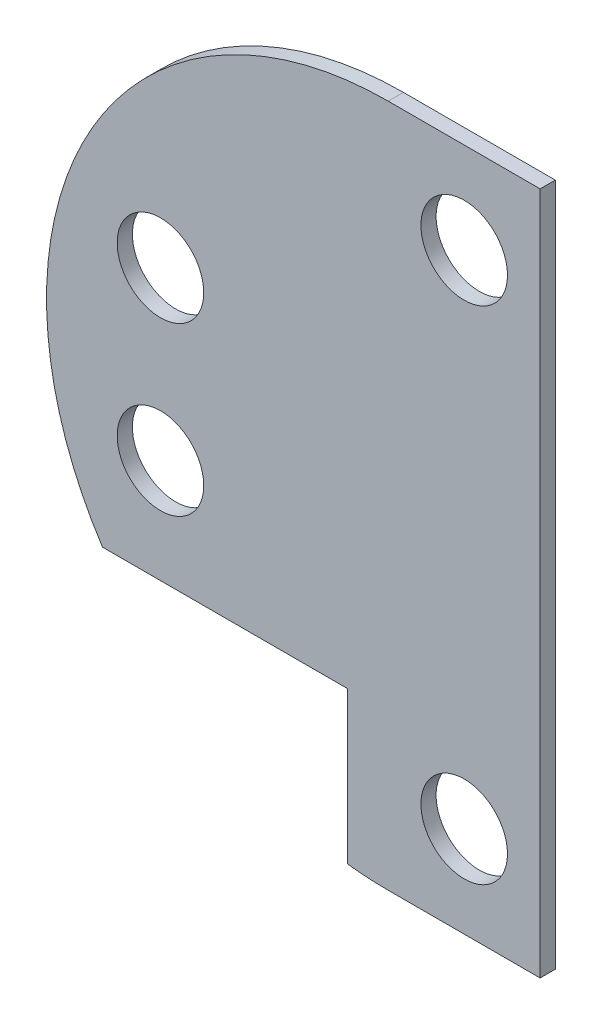
ISO-10303-21;
HEADER;
FILE_DESCRIPTION(('STEP AP214'),'2;1');
FILE_NAME('part.step','',(''),(''),'','','');
FILE_SCHEMA(('AUTOMOTIVE_DESIGN { 1 0 10303 214 1 1 1 1 }'));
ENDSEC;
DATA;
#1=APPLICATION_CONTEXT('core data for automotive mechanical design processes');
#2=APPLICATION_PROTOCOL_DEFINITION('international standard','automotive_design',2000,#1);
#3=PRODUCT_CONTEXT('',#1,'mechanical');
#4=PRODUCT('Part','Part','',(#3));
#5=PRODUCT_RELATED_PRODUCT_CATEGORY('part','',(#4));
#6=PRODUCT_DEFINITION_FORMATION('','',#4);
#7=PRODUCT_DEFINITION_CONTEXT('part definition',#1,'design');
#8=PRODUCT_DEFINITION('design','',#6,#7);
#9=PRODUCT_DEFINITION_SHAPE('','',#8);
#10=(LENGTH_UNIT() NAMED_UNIT(*) SI_UNIT(.MILLI.,.METRE.));
#11=(NAMED_UNIT(*) PLANE_ANGLE_UNIT() SI_UNIT($,.RADIAN.));
#12=(NAMED_UNIT(*) SI_UNIT($,.STERADIAN.) SOLID_ANGLE_UNIT());
#13=UNCERTAINTY_MEASURE_WITH_UNIT(LENGTH_MEASURE(1.E-05),#10,'distance_accuracy_value','');
#14=(GEOMETRIC_REPRESENTATION_CONTEXT(3) GLOBAL_UNCERTAINTY_ASSIGNED_CONTEXT((#13)) GLOBAL_UNIT_ASSIGNED_CONTEXT((#10,
#11,#12)) REPRESENTATION_CONTEXT('',''));
#15=CARTESIAN_POINT('',(0.,0.,0.));
#16=DIRECTION('',(0.,0.,1.));
#17=DIRECTION('',(1.,0.,0.));
#18=AXIS2_PLACEMENT_3D('',#15,#16,#17);
#19=CARTESIAN_POINT('',(-5.,0.,1.));
#20=DIRECTION('',(0.,0.,-1.));
#21=DIRECTION('',(-1.,0.,0.));
#22=AXIS2_PLACEMENT_3D('',#19,#20,#21);
#23=CYLINDRICAL_SURFACE('',#22,22.5);
#24=DIRECTION('',(0.,0.,-1.));
#25=VECTOR('',#24,1.);
#26=CARTESIAN_POINT('',(-23.8142073976025,-12.34,1.));
#27=LINE('',#26,#25);
#28=CARTESIAN_POINT('',(-23.8142073976025,-12.34,1.));
#29=VERTEX_POINT('',#28);
#30=CARTESIAN_POINT('',(-23.8142073976025,-12.34,0.));
#31=VERTEX_POINT('',#30);
#32=EDGE_CURVE('E117',#29,#31,#27,.T.);
#33=ORIENTED_EDGE('',*,*,#32,.F.);
#34=CARTESIAN_POINT('',(-5.,0.,1.));
#35=DIRECTION('',(0.,0.,1.));
#36=DIRECTION('',(-1.,0.,0.));
#37=AXIS2_PLACEMENT_3D('',#34,#35,#36);
#38=CIRCLE('',#37,22.5);
#39=CARTESIAN_POINT('',(-5.,22.5,1.));
#40=VERTEX_POINT('',#39);
#41=EDGE_CURVE('E128',#40,#29,#38,.T.);
#42=ORIENTED_EDGE('',*,*,#41,.F.);
#43=DIRECTION('',(0.,0.,-1.));
#44=VECTOR('',#43,1.);
#45=CARTESIAN_POINT('',(-5.,22.5,1.));
#46=LINE('',#45,#44);
#47=CARTESIAN_POINT('',(-5.,22.5,0.));
#48=VERTEX_POINT('',#47);
#49=EDGE_CURVE('E48',#40,#48,#46,.T.);
#50=ORIENTED_EDGE('',*,*,#49,.T.);
#51=CARTESIAN_POINT('',(-5.,0.,0.));
#52=DIRECTION('',(0.,0.,1.));
#53=DIRECTION('',(-1.,0.,0.));
#54=AXIS2_PLACEMENT_3D('',#51,#52,#53);
#55=CIRCLE('',#54,22.5);
#56=EDGE_CURVE('E143',#48,#31,#55,.T.);
#57=ORIENTED_EDGE('',*,*,#56,.T.);
#58=EDGE_LOOP('',(#33,#42,#50,#57));
#59=FACE_BOUND('',#58,.T.);
#60=ADVANCED_FACE('F40',(#59),#23,.T.);
#61=CARTESIAN_POINT('',(-5.,0.,1.));
#62=DIRECTION('',(0.,0.,-1.));
#63=DIRECTION('',(-1.,0.,0.));
#64=AXIS2_PLACEMENT_3D('',#61,#62,#63);
#65=PLANE('',#64);
#66=DIRECTION('',(-1.,0.,0.));
#67=VECTOR('',#66,1.);
#68=CARTESIAN_POINT('',(-7.7,-12.34,1.));
#69=LINE('',#68,#67);
#70=CARTESIAN_POINT('',(-7.7,-12.34,1.));
#71=VERTEX_POINT('',#70);
#72=EDGE_CURVE('E55',#71,#29,#69,.T.);
#73=ORIENTED_EDGE('',*,*,#72,.F.);
#74=DIRECTION('',(0.,-1.,0.));
#75=VECTOR('',#74,1.);
#76=CARTESIAN_POINT('',(-7.7,-12.34,1.));
#77=LINE('',#76,#75);
#78=CARTESIAN_POINT('',(-7.69999999999999,-22.3374125627835,1.));
#79=VERTEX_POINT('',#78);
#80=EDGE_CURVE('E111',#71,#79,#77,.T.);
#81=ORIENTED_EDGE('',*,*,#80,.T.);
#82=CARTESIAN_POINT('',(-5.,-22.5,1.));
#83=VERTEX_POINT('',#82);
#84=EDGE_CURVE('E121',#79,#83,#38,.T.);
#85=ORIENTED_EDGE('',*,*,#84,.T.);
#86=DIRECTION('',(1.,0.,0.));
#87=VECTOR('',#86,1.);
#88=CARTESIAN_POINT('',(-5.,-22.5,1.));
#89=LINE('',#88,#87);
#90=CARTESIAN_POINT('',(5.,-22.5,1.));
#91=VERTEX_POINT('',#90);
#92=EDGE_CURVE('E64',#83,#91,#89,.T.);
#93=ORIENTED_EDGE('',*,*,#92,.T.);
#94=DIRECTION('',(0.,1.,0.));
#95=VECTOR('',#94,1.);
#96=CARTESIAN_POINT('',(5.,-22.5,1.));
#97=LINE('',#96,#95);
#98=CARTESIAN_POINT('',(5.,22.5,1.));
#99=VERTEX_POINT('',#98);
#100=EDGE_CURVE('E130',#91,#99,#97,.T.);
#101=ORIENTED_EDGE('',*,*,#100,.T.);
#102=DIRECTION('',(-1.,0.,0.));
#103=VECTOR('',#102,1.);
#104=CARTESIAN_POINT('',(-5.,22.5,1.));
#105=LINE('',#104,#103);
#106=EDGE_CURVE('E92',#99,#40,#105,.T.);
#107=ORIENTED_EDGE('',*,*,#106,.T.);
#108=ORIENTED_EDGE('',*,*,#41,.T.);
#109=EDGE_LOOP('',(#73,#81,#85,#93,#101,#107,#108));
#110=FACE_BOUND('',#109,.T.);
#111=CARTESIAN_POINT('',(0.,16.5,1.));
#112=DIRECTION('',(0.,0.,1.));
#113=DIRECTION('',(1.,0.,0.));
#114=AXIS2_PLACEMENT_3D('',#111,#112,#113);
#115=CIRCLE('',#114,2.85);
#116=CARTESIAN_POINT('',(2.85,16.5,1.));
#117=VERTEX_POINT('',#116);
#118=EDGE_CURVE('E140',#117,#117,#115,.T.);
#119=ORIENTED_EDGE('',*,*,#118,.F.);
#120=EDGE_LOOP('',(#119));
#121=FACE_BOUND('',#120,.T.);
#122=CARTESIAN_POINT('',(0.,-16.5,1.));
#123=DIRECTION('',(0.,0.,1.));
#124=DIRECTION('',(1.,0.,0.));
#125=AXIS2_PLACEMENT_3D('',#122,#123,#124);
#126=CIRCLE('',#125,2.85);
#127=CARTESIAN_POINT('',(2.85,-16.5,1.));
#128=VERTEX_POINT('',#127);
#129=EDGE_CURVE('E178',#128,#128,#126,.T.);
#130=ORIENTED_EDGE('',*,*,#129,.F.);
#131=EDGE_LOOP('',(#130));
#132=FACE_BOUND('',#131,.T.);
#133=CARTESIAN_POINT('',(-20.,-5.5,1.));
#134=DIRECTION('',(0.,0.,1.));
#135=DIRECTION('',(1.,0.,0.));
#136=AXIS2_PLACEMENT_3D('',#133,#134,#135);
#137=CIRCLE('',#136,2.85);
#138=CARTESIAN_POINT('',(-17.15,-5.5,1.));
#139=VERTEX_POINT('',#138);
#140=EDGE_CURVE('E172',#139,#139,#137,.T.);
#141=ORIENTED_EDGE('',*,*,#140,.F.);
#142=EDGE_LOOP('',(#141));
#143=FACE_BOUND('',#142,.T.);
#144=CARTESIAN_POINT('',(-20.,5.5,1.));
#145=DIRECTION('',(0.,0.,1.));
#146=DIRECTION('',(1.,0.,0.));
#147=AXIS2_PLACEMENT_3D('',#144,#145,#146);
#148=CIRCLE('',#147,2.85);
#149=CARTESIAN_POINT('',(-17.15,5.5,1.));
#150=VERTEX_POINT('',#149);
#151=EDGE_CURVE('E166',#150,#150,#148,.T.);
#152=ORIENTED_EDGE('',*,*,#151,.F.);
#153=EDGE_LOOP('',(#152));
#154=FACE_BOUND('',#153,.T.);
#155=ADVANCED_FACE('F119',(#110,#121,#132,#143,#154),#65,.F.);
#156=CARTESIAN_POINT('',(-5.,0.,0.));
#157=DIRECTION('',(0.,0.,-1.));
#158=DIRECTION('',(-1.,0.,0.));
#159=AXIS2_PLACEMENT_3D('',#156,#157,#158);
#160=PLANE('',#159);
#161=DIRECTION('',(0.,-1.,0.));
#162=VECTOR('',#161,1.);
#163=CARTESIAN_POINT('',(-7.7,-12.34,0.));
#164=LINE('',#163,#162);
#165=CARTESIAN_POINT('',(-7.7,-12.34,0.));
#166=VERTEX_POINT('',#165);
#167=CARTESIAN_POINT('',(-7.69999999999999,-22.3374125627835,0.));
#168=VERTEX_POINT('',#167);
#169=EDGE_CURVE('E113',#166,#168,#164,.T.);
#170=ORIENTED_EDGE('',*,*,#169,.F.);
#171=DIRECTION('',(-1.,0.,0.));
#172=VECTOR('',#171,1.);
#173=CARTESIAN_POINT('',(-7.7,-12.34,0.));
#174=LINE('',#173,#172);
#175=EDGE_CURVE('E124',#166,#31,#174,.T.);
#176=ORIENTED_EDGE('',*,*,#175,.T.);
#177=ORIENTED_EDGE('',*,*,#56,.F.);
#178=DIRECTION('',(-1.,0.,0.));
#179=VECTOR('',#178,1.);
#180=CARTESIAN_POINT('',(-5.,22.5,0.));
#181=LINE('',#180,#179);
#182=CARTESIAN_POINT('',(5.,22.5,0.));
#183=VERTEX_POINT('',#182);
#184=EDGE_CURVE('E139',#183,#48,#181,.T.);
#185=ORIENTED_EDGE('',*,*,#184,.F.);
#186=DIRECTION('',(0.,1.,0.));
#187=VECTOR('',#186,1.);
#188=CARTESIAN_POINT('',(5.,-22.5,0.));
#189=LINE('',#188,#187);
#190=CARTESIAN_POINT('',(5.,-22.5,0.));
#191=VERTEX_POINT('',#190);
#192=EDGE_CURVE('E136',#191,#183,#189,.T.);
#193=ORIENTED_EDGE('',*,*,#192,.F.);
#194=DIRECTION('',(1.,0.,0.));
#195=VECTOR('',#194,1.);
#196=CARTESIAN_POINT('',(-5.,-22.5,0.));
#197=LINE('',#196,#195);
#198=CARTESIAN_POINT('',(-5.,-22.5,0.));
#199=VERTEX_POINT('',#198);
#200=EDGE_CURVE('E85',#199,#191,#197,.T.);
#201=ORIENTED_EDGE('',*,*,#200,.F.);
#202=EDGE_CURVE('E142',#168,#199,#55,.T.);
#203=ORIENTED_EDGE('',*,*,#202,.F.);
#204=EDGE_LOOP('',(#170,#176,#177,#185,#193,#201,#203));
#205=FACE_BOUND('',#204,.T.);
#206=CARTESIAN_POINT('',(-20.,-5.5,0.));
#207=DIRECTION('',(0.,0.,1.));
#208=DIRECTION('',(1.,0.,0.));
#209=AXIS2_PLACEMENT_3D('',#206,#207,#208);
#210=CIRCLE('',#209,2.85);
#211=CARTESIAN_POINT('',(-17.15,-5.5,0.));
#212=VERTEX_POINT('',#211);
#213=EDGE_CURVE('E169',#212,#212,#210,.T.);
#214=ORIENTED_EDGE('',*,*,#213,.T.);
#215=EDGE_LOOP('',(#214));
#216=FACE_BOUND('',#215,.T.);
#217=CARTESIAN_POINT('',(0.,16.5,0.));
#218=DIRECTION('',(0.,0.,1.));
#219=DIRECTION('',(1.,0.,0.));
#220=AXIS2_PLACEMENT_3D('',#217,#218,#219);
#221=CIRCLE('',#220,2.85);
#222=CARTESIAN_POINT('',(2.85,16.5,0.));
#223=VERTEX_POINT('',#222);
#224=EDGE_CURVE('E181',#223,#223,#221,.T.);
#225=ORIENTED_EDGE('',*,*,#224,.T.);
#226=EDGE_LOOP('',(#225));
#227=FACE_BOUND('',#226,.T.);
#228=CARTESIAN_POINT('',(0.,-16.5,0.));
#229=DIRECTION('',(0.,0.,1.));
#230=DIRECTION('',(1.,0.,0.));
#231=AXIS2_PLACEMENT_3D('',#228,#229,#230);
#232=CIRCLE('',#231,2.85);
#233=CARTESIAN_POINT('',(2.85,-16.5,0.));
#234=VERTEX_POINT('',#233);
#235=EDGE_CURVE('E175',#234,#234,#232,.T.);
#236=ORIENTED_EDGE('',*,*,#235,.T.);
#237=EDGE_LOOP('',(#236));
#238=FACE_BOUND('',#237,.T.);
#239=CARTESIAN_POINT('',(-20.,5.5,0.));
#240=DIRECTION('',(0.,0.,1.));
#241=DIRECTION('',(1.,0.,0.));
#242=AXIS2_PLACEMENT_3D('',#239,#240,#241);
#243=CIRCLE('',#242,2.85);
#244=CARTESIAN_POINT('',(-17.15,5.5,0.));
#245=VERTEX_POINT('',#244);
#246=EDGE_CURVE('E164',#245,#245,#243,.T.);
#247=ORIENTED_EDGE('',*,*,#246,.T.);
#248=EDGE_LOOP('',(#247));
#249=FACE_BOUND('',#248,.T.);
#250=ADVANCED_FACE('F154',(#205,#216,#227,#238,#249),#160,.T.);
#251=CARTESIAN_POINT('',(5.,-22.5,1.));
#252=DIRECTION('',(-1.,0.,0.));
#253=DIRECTION('',(0.,-1.,0.));
#254=AXIS2_PLACEMENT_3D('',#251,#252,#253);
#255=PLANE('',#254);
#256=ORIENTED_EDGE('',*,*,#192,.T.);
#257=DIRECTION('',(0.,0.,-1.));
#258=VECTOR('',#257,1.);
#259=CARTESIAN_POINT('',(5.,22.5,1.));
#260=LINE('',#259,#258);
#261=EDGE_CURVE('E11',#99,#183,#260,.T.);
#262=ORIENTED_EDGE('',*,*,#261,.F.);
#263=ORIENTED_EDGE('',*,*,#100,.F.);
#264=DIRECTION('',(0.,0.,-1.));
#265=VECTOR('',#264,1.);
#266=CARTESIAN_POINT('',(5.,-22.5,1.));
#267=LINE('',#266,#265);
#268=EDGE_CURVE('E135',#91,#191,#267,.T.);
#269=ORIENTED_EDGE('',*,*,#268,.T.);
#270=EDGE_LOOP('',(#256,#262,#263,#269));
#271=FACE_BOUND('',#270,.T.);
#272=ADVANCED_FACE('F42',(#271),#255,.F.);
#273=CARTESIAN_POINT('',(-5.,22.5,1.));
#274=DIRECTION('',(0.,-1.,0.));
#275=DIRECTION('',(0.,0.,-1.));
#276=AXIS2_PLACEMENT_3D('',#273,#274,#275);
#277=PLANE('',#276);
#278=ORIENTED_EDGE('',*,*,#184,.T.);
#279=ORIENTED_EDGE('',*,*,#49,.F.);
#280=ORIENTED_EDGE('',*,*,#106,.F.);
#281=ORIENTED_EDGE('',*,*,#261,.T.);
#282=EDGE_LOOP('',(#278,#279,#280,#281));
#283=FACE_BOUND('',#282,.T.);
#284=ADVANCED_FACE('F190',(#283),#277,.F.);
#285=ORIENTED_EDGE('',*,*,#84,.F.);
#286=DIRECTION('',(0.,0.,-1.));
#287=VECTOR('',#286,1.);
#288=CARTESIAN_POINT('',(-7.69999999999999,-22.3374125627835,1.));
#289=LINE('',#288,#287);
#290=EDGE_CURVE('E108',#79,#168,#289,.T.);
#291=ORIENTED_EDGE('',*,*,#290,.T.);
#292=ORIENTED_EDGE('',*,*,#202,.T.);
#293=DIRECTION('',(0.,0.,-1.));
#294=VECTOR('',#293,1.);
#295=CARTESIAN_POINT('',(-5.,-22.5,1.));
#296=LINE('',#295,#294);
#297=EDGE_CURVE('E127',#83,#199,#296,.T.);
#298=ORIENTED_EDGE('',*,*,#297,.F.);
#299=EDGE_LOOP('',(#285,#291,#292,#298));
#300=FACE_BOUND('',#299,.T.);
#301=ADVANCED_FACE('F126',(#300),#23,.T.);
#302=CARTESIAN_POINT('',(-5.,-22.5,1.));
#303=DIRECTION('',(0.,1.,0.));
#304=DIRECTION('',(0.,0.,1.));
#305=AXIS2_PLACEMENT_3D('',#302,#303,#304);
#306=PLANE('',#305);
#307=ORIENTED_EDGE('',*,*,#200,.T.);
#308=ORIENTED_EDGE('',*,*,#268,.F.);
#309=ORIENTED_EDGE('',*,*,#92,.F.);
#310=ORIENTED_EDGE('',*,*,#297,.T.);
#311=EDGE_LOOP('',(#307,#308,#309,#310));
#312=FACE_BOUND('',#311,.T.);
#313=ADVANCED_FACE('F196',(#312),#306,.F.);
#314=CARTESIAN_POINT('',(0.,16.5,1.));
#315=DIRECTION('',(0.,0.,-1.));
#316=DIRECTION('',(-1.,0.,0.));
#317=AXIS2_PLACEMENT_3D('',#314,#315,#316);
#318=CYLINDRICAL_SURFACE('',#317,2.85);
#319=ORIENTED_EDGE('',*,*,#118,.T.);
#320=EDGE_LOOP('',(#319));
#321=FACE_BOUND('',#320,.T.);
#322=ORIENTED_EDGE('',*,*,#224,.F.);
#323=EDGE_LOOP('',(#322));
#324=FACE_BOUND('',#323,.T.);
#325=ADVANCED_FACE('F206',(#321,#324),#318,.F.);
#326=CARTESIAN_POINT('',(0.,-16.5,1.));
#327=DIRECTION('',(0.,0.,-1.));
#328=DIRECTION('',(-1.,0.,0.));
#329=AXIS2_PLACEMENT_3D('',#326,#327,#328);
#330=CYLINDRICAL_SURFACE('',#329,2.85);
#331=ORIENTED_EDGE('',*,*,#129,.T.);
#332=EDGE_LOOP('',(#331));
#333=FACE_BOUND('',#332,.T.);
#334=ORIENTED_EDGE('',*,*,#235,.F.);
#335=EDGE_LOOP('',(#334));
#336=FACE_BOUND('',#335,.T.);
#337=ADVANCED_FACE('F211',(#333,#336),#330,.F.);
#338=CARTESIAN_POINT('',(-20.,-5.5,1.));
#339=DIRECTION('',(0.,0.,-1.));
#340=DIRECTION('',(-1.,0.,0.));
#341=AXIS2_PLACEMENT_3D('',#338,#339,#340);
#342=CYLINDRICAL_SURFACE('',#341,2.85);
#343=ORIENTED_EDGE('',*,*,#140,.T.);
#344=EDGE_LOOP('',(#343));
#345=FACE_BOUND('',#344,.T.);
#346=ORIENTED_EDGE('',*,*,#213,.F.);
#347=EDGE_LOOP('',(#346));
#348=FACE_BOUND('',#347,.T.);
#349=ADVANCED_FACE('F215',(#345,#348),#342,.F.);
#350=CARTESIAN_POINT('',(-20.,5.5,1.));
#351=DIRECTION('',(0.,0.,-1.));
#352=DIRECTION('',(-1.,0.,0.));
#353=AXIS2_PLACEMENT_3D('',#350,#351,#352);
#354=CYLINDRICAL_SURFACE('',#353,2.85);
#355=ORIENTED_EDGE('',*,*,#151,.T.);
#356=EDGE_LOOP('',(#355));
#357=FACE_BOUND('',#356,.T.);
#358=ORIENTED_EDGE('',*,*,#246,.F.);
#359=EDGE_LOOP('',(#358));
#360=FACE_BOUND('',#359,.T.);
#361=ADVANCED_FACE('F219',(#357,#360),#354,.F.);
#362=CARTESIAN_POINT('',(-7.7,-12.34,1.));
#363=DIRECTION('',(1.,0.,0.));
#364=DIRECTION('',(0.,1.,0.));
#365=AXIS2_PLACEMENT_3D('',#362,#363,#364);
#366=PLANE('',#365);
#367=ORIENTED_EDGE('',*,*,#169,.T.);
#368=ORIENTED_EDGE('',*,*,#290,.F.);
#369=ORIENTED_EDGE('',*,*,#80,.F.);
#370=DIRECTION('',(0.,0.,-1.));
#371=VECTOR('',#370,1.);
#372=CARTESIAN_POINT('',(-7.7,-12.34,1.));
#373=LINE('',#372,#371);
#374=EDGE_CURVE('E162',#71,#166,#373,.T.);
#375=ORIENTED_EDGE('',*,*,#374,.T.);
#376=EDGE_LOOP('',(#367,#368,#369,#375));
#377=FACE_BOUND('',#376,.T.);
#378=ADVANCED_FACE('F110',(#377),#366,.F.);
#379=CARTESIAN_POINT('',(-7.7,-12.34,1.));
#380=DIRECTION('',(0.,-1.,0.));
#381=DIRECTION('',(0.,0.,-1.));
#382=AXIS2_PLACEMENT_3D('',#379,#380,#381);
#383=PLANE('',#382);
#384=ORIENTED_EDGE('',*,*,#175,.F.);
#385=ORIENTED_EDGE('',*,*,#374,.F.);
#386=ORIENTED_EDGE('',*,*,#72,.T.);
#387=ORIENTED_EDGE('',*,*,#32,.T.);
#388=EDGE_LOOP('',(#384,#385,#386,#387));
#389=FACE_BOUND('',#388,.T.);
#390=ADVANCED_FACE('F226',(#389),#383,.T.);
#391=CLOSED_SHELL('',(#60,#155,#250,#272,#284,#301,#313,#325,#337,#349,#361,#378,#390));
#392=MANIFOLD_SOLID_BREP('B2',#391);
#393=ADVANCED_BREP_SHAPE_REPRESENTATION('',(#18,#392),#14);
#394=SHAPE_DEFINITION_REPRESENTATION(#9,#393);
ENDSEC;
END-ISO-10303-21;
